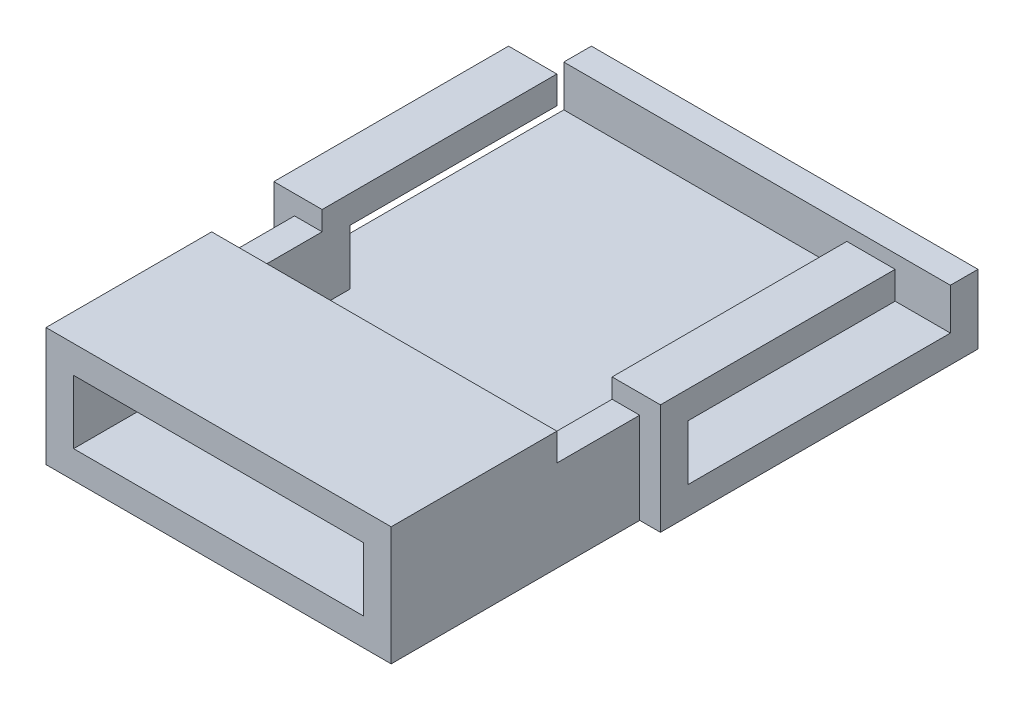
ISO-10303-21;
HEADER;
FILE_DESCRIPTION(('STEP AP214'),'2;1');
FILE_NAME('part.step','',(''),(''),'','','');
FILE_SCHEMA(('AUTOMOTIVE_DESIGN { 1 0 10303 214 1 1 1 1 }'));
ENDSEC;
DATA;
#1=APPLICATION_CONTEXT('core data for automotive mechanical design processes');
#2=APPLICATION_PROTOCOL_DEFINITION('international standard','automotive_design',2000,#1);
#3=PRODUCT_CONTEXT('',#1,'mechanical');
#4=PRODUCT('Part','Part','',(#3));
#5=PRODUCT_RELATED_PRODUCT_CATEGORY('part','',(#4));
#6=PRODUCT_DEFINITION_FORMATION('','',#4);
#7=PRODUCT_DEFINITION_CONTEXT('part definition',#1,'design');
#8=PRODUCT_DEFINITION('design','',#6,#7);
#9=PRODUCT_DEFINITION_SHAPE('','',#8);
#10=(LENGTH_UNIT() NAMED_UNIT(*) SI_UNIT(.MILLI.,.METRE.));
#11=(NAMED_UNIT(*) PLANE_ANGLE_UNIT() SI_UNIT($,.RADIAN.));
#12=(NAMED_UNIT(*) SI_UNIT($,.STERADIAN.) SOLID_ANGLE_UNIT());
#13=UNCERTAINTY_MEASURE_WITH_UNIT(LENGTH_MEASURE(1.E-05),#10,'distance_accuracy_value','');
#14=(GEOMETRIC_REPRESENTATION_CONTEXT(3) GLOBAL_UNCERTAINTY_ASSIGNED_CONTEXT((#13)) GLOBAL_UNIT_ASSIGNED_CONTEXT((#10,
#11,#12)) REPRESENTATION_CONTEXT('',''));
#15=CARTESIAN_POINT('',(0.,0.,0.));
#16=DIRECTION('',(0.,0.,1.));
#17=DIRECTION('',(1.,0.,0.));
#18=AXIS2_PLACEMENT_3D('',#15,#16,#17);
#19=CARTESIAN_POINT('',(-7.,0.,-10.5));
#20=DIRECTION('',(-1.,0.,0.));
#21=DIRECTION('',(0.,0.,1.));
#22=AXIS2_PLACEMENT_3D('',#19,#20,#21);
#23=PLANE('',#22);
#24=DIRECTION('',(0.,1.,0.));
#25=VECTOR('',#24,1.);
#26=CARTESIAN_POINT('',(-7.,1.,-9.5));
#27=LINE('',#26,#25);
#28=CARTESIAN_POINT('',(-7.,1.,-9.5));
#29=VERTEX_POINT('',#28);
#30=CARTESIAN_POINT('',(-7.,2.5,-9.5));
#31=VERTEX_POINT('',#30);
#32=EDGE_CURVE('E318',#29,#31,#27,.T.);
#33=ORIENTED_EDGE('',*,*,#32,.T.);
#34=DIRECTION('',(0.,0.,1.));
#35=VECTOR('',#34,1.);
#36=CARTESIAN_POINT('',(-7.,2.5,-10.5));
#37=LINE('',#36,#35);
#38=CARTESIAN_POINT('',(-7.,2.5,-10.5));
#39=VERTEX_POINT('',#38);
#40=EDGE_CURVE('E54',#39,#31,#37,.T.);
#41=ORIENTED_EDGE('',*,*,#40,.F.);
#42=DIRECTION('',(0.,1.,0.));
#43=VECTOR('',#42,1.);
#44=CARTESIAN_POINT('',(-7.,0.,-10.5));
#45=LINE('',#44,#43);
#46=CARTESIAN_POINT('',(-7.,0.,-10.5));
#47=VERTEX_POINT('',#46);
#48=EDGE_CURVE('E388',#47,#39,#45,.T.);
#49=ORIENTED_EDGE('',*,*,#48,.F.);
#50=DIRECTION('',(0.,0.,1.));
#51=VECTOR('',#50,1.);
#52=CARTESIAN_POINT('',(-7.,0.,-10.5));
#53=LINE('',#52,#51);
#54=CARTESIAN_POINT('',(-7.,0.,1.));
#55=VERTEX_POINT('',#54);
#56=EDGE_CURVE('E363',#47,#55,#53,.T.);
#57=ORIENTED_EDGE('',*,*,#56,.T.);
#58=DIRECTION('',(0.,1.,0.));
#59=VECTOR('',#58,1.);
#60=CARTESIAN_POINT('',(-7.,0.,1.));
#61=LINE('',#60,#59);
#62=CARTESIAN_POINT('',(-7.,4.,1.));
#63=VERTEX_POINT('',#62);
#64=EDGE_CURVE('E232',#55,#63,#61,.T.);
#65=ORIENTED_EDGE('',*,*,#64,.T.);
#66=DIRECTION('',(0.,0.,-1.));
#67=VECTOR('',#66,1.);
#68=CARTESIAN_POINT('',(-7.,4.,0.));
#69=LINE('',#68,#67);
#70=CARTESIAN_POINT('',(-7.,4.,-7.5));
#71=VERTEX_POINT('',#70);
#72=EDGE_CURVE('E224',#63,#71,#69,.T.);
#73=ORIENTED_EDGE('',*,*,#72,.T.);
#74=DIRECTION('',(0.,-1.,0.));
#75=VECTOR('',#74,1.);
#76=CARTESIAN_POINT('',(-7.,4.,-7.5));
#77=LINE('',#76,#75);
#78=CARTESIAN_POINT('',(-7.,3.,-7.5));
#79=VERTEX_POINT('',#78);
#80=EDGE_CURVE('E208',#71,#79,#77,.T.);
#81=ORIENTED_EDGE('',*,*,#80,.T.);
#82=DIRECTION('',(0.,0.,-1.));
#83=VECTOR('',#82,1.);
#84=CARTESIAN_POINT('',(-7.,3.,0.));
#85=LINE('',#84,#83);
#86=CARTESIAN_POINT('',(-7.,3.,0.));
#87=VERTEX_POINT('',#86);
#88=EDGE_CURVE('E241',#87,#79,#85,.T.);
#89=ORIENTED_EDGE('',*,*,#88,.F.);
#90=DIRECTION('',(0.,1.,0.));
#91=VECTOR('',#90,1.);
#92=CARTESIAN_POINT('',(-7.,1.,0.));
#93=LINE('',#92,#91);
#94=CARTESIAN_POINT('',(-7.,1.,0.));
#95=VERTEX_POINT('',#94);
#96=EDGE_CURVE('E320',#95,#87,#93,.T.);
#97=ORIENTED_EDGE('',*,*,#96,.F.);
#98=DIRECTION('',(0.,0.,1.));
#99=VECTOR('',#98,1.);
#100=CARTESIAN_POINT('',(-7.,1.,0.));
#101=LINE('',#100,#99);
#102=EDGE_CURVE('E315',#29,#95,#101,.T.);
#103=ORIENTED_EDGE('',*,*,#102,.F.);
#104=EDGE_LOOP('',(#33,#41,#49,#57,#65,#73,#81,#89,#97,#103));
#105=FACE_BOUND('',#104,.T.);
#106=ADVANCED_FACE('F37',(#105),#23,.T.);
#107=CARTESIAN_POINT('',(7.00000000000001,0.,-10.5));
#108=DIRECTION('',(0.,0.,-1.));
#109=DIRECTION('',(-1.,0.,0.));
#110=AXIS2_PLACEMENT_3D('',#107,#108,#109);
#111=PLANE('',#110);
#112=ORIENTED_EDGE('',*,*,#48,.T.);
#113=DIRECTION('',(-1.,0.,0.));
#114=VECTOR('',#113,1.);
#115=CARTESIAN_POINT('',(7.00000000000001,2.5,-10.5));
#116=LINE('',#115,#114);
#117=CARTESIAN_POINT('',(7.00000000000001,2.5,-10.5));
#118=VERTEX_POINT('',#117);
#119=EDGE_CURVE('E273',#118,#39,#116,.T.);
#120=ORIENTED_EDGE('',*,*,#119,.F.);
#121=DIRECTION('',(0.,1.,0.));
#122=VECTOR('',#121,1.);
#123=CARTESIAN_POINT('',(7.00000000000001,0.,-10.5));
#124=LINE('',#123,#122);
#125=CARTESIAN_POINT('',(7.00000000000001,0.,-10.5));
#126=VERTEX_POINT('',#125);
#127=EDGE_CURVE('E391',#126,#118,#124,.T.);
#128=ORIENTED_EDGE('',*,*,#127,.F.);
#129=DIRECTION('',(-1.,0.,0.));
#130=VECTOR('',#129,1.);
#131=CARTESIAN_POINT('',(7.00000000000001,0.,-10.5));
#132=LINE('',#131,#130);
#133=EDGE_CURVE('E360',#126,#47,#132,.T.);
#134=ORIENTED_EDGE('',*,*,#133,.T.);
#135=EDGE_LOOP('',(#112,#120,#128,#134));
#136=FACE_BOUND('',#135,.T.);
#137=ADVANCED_FACE('F437',(#136),#111,.T.);
#138=CARTESIAN_POINT('',(7.00000000000001,0.,1.));
#139=DIRECTION('',(1.,0.,0.));
#140=DIRECTION('',(0.,0.,-1.));
#141=AXIS2_PLACEMENT_3D('',#138,#139,#140);
#142=PLANE('',#141);
#143=ORIENTED_EDGE('',*,*,#127,.T.);
#144=DIRECTION('',(0.,0.,-1.));
#145=VECTOR('',#144,1.);
#146=CARTESIAN_POINT('',(7.00000000000001,2.5,-9.5));
#147=LINE('',#146,#145);
#148=CARTESIAN_POINT('',(7.00000000000001,2.5,-9.5));
#149=VERTEX_POINT('',#148);
#150=EDGE_CURVE('E278',#149,#118,#147,.T.);
#151=ORIENTED_EDGE('',*,*,#150,.F.);
#152=DIRECTION('',(0.,1.,0.));
#153=VECTOR('',#152,1.);
#154=CARTESIAN_POINT('',(7.00000000000001,1.,-9.5));
#155=LINE('',#154,#153);
#156=CARTESIAN_POINT('',(7.00000000000001,1.,-9.5));
#157=VERTEX_POINT('',#156);
#158=EDGE_CURVE('E319',#157,#149,#155,.T.);
#159=ORIENTED_EDGE('',*,*,#158,.F.);
#160=DIRECTION('',(0.,0.,-1.));
#161=VECTOR('',#160,1.);
#162=CARTESIAN_POINT('',(7.00000000000001,1.,-9.5));
#163=LINE('',#162,#161);
#164=CARTESIAN_POINT('',(7.00000000000001,1.,0.));
#165=VERTEX_POINT('',#164);
#166=EDGE_CURVE('E324',#165,#157,#163,.T.);
#167=ORIENTED_EDGE('',*,*,#166,.F.);
#168=DIRECTION('',(0.,1.,0.));
#169=VECTOR('',#168,1.);
#170=CARTESIAN_POINT('',(7.00000000000001,1.,0.));
#171=LINE('',#170,#169);
#172=CARTESIAN_POINT('',(7.00000000000001,3.,0.));
#173=VERTEX_POINT('',#172);
#174=EDGE_CURVE('E327',#165,#173,#171,.T.);
#175=ORIENTED_EDGE('',*,*,#174,.T.);
#176=DIRECTION('',(0.,0.,-1.));
#177=VECTOR('',#176,1.);
#178=CARTESIAN_POINT('',(7.00000000000001,3.,0.));
#179=LINE('',#178,#177);
#180=CARTESIAN_POINT('',(7.00000000000001,3.,-7.5));
#181=VERTEX_POINT('',#180);
#182=EDGE_CURVE('E251',#173,#181,#179,.T.);
#183=ORIENTED_EDGE('',*,*,#182,.T.);
#184=DIRECTION('',(0.,-1.,0.));
#185=VECTOR('',#184,1.);
#186=CARTESIAN_POINT('',(7.00000000000001,4.,-7.5));
#187=LINE('',#186,#185);
#188=CARTESIAN_POINT('',(7.00000000000001,4.,-7.5));
#189=VERTEX_POINT('',#188);
#190=EDGE_CURVE('E259',#189,#181,#187,.T.);
#191=ORIENTED_EDGE('',*,*,#190,.F.);
#192=DIRECTION('',(0.,0.,-1.));
#193=VECTOR('',#192,1.);
#194=CARTESIAN_POINT('',(7.00000000000001,4.,0.));
#195=LINE('',#194,#193);
#196=CARTESIAN_POINT('',(7.00000000000001,4.,1.));
#197=VERTEX_POINT('',#196);
#198=EDGE_CURVE('E257',#197,#189,#195,.T.);
#199=ORIENTED_EDGE('',*,*,#198,.F.);
#200=DIRECTION('',(0.,1.,0.));
#201=VECTOR('',#200,1.);
#202=CARTESIAN_POINT('',(7.00000000000001,0.,1.));
#203=LINE('',#202,#201);
#204=CARTESIAN_POINT('',(7.00000000000001,0.,1.));
#205=VERTEX_POINT('',#204);
#206=EDGE_CURVE('E377',#205,#197,#203,.T.);
#207=ORIENTED_EDGE('',*,*,#206,.F.);
#208=DIRECTION('',(0.,0.,-1.));
#209=VECTOR('',#208,1.);
#210=CARTESIAN_POINT('',(7.00000000000001,0.,1.));
#211=LINE('',#210,#209);
#212=EDGE_CURVE('E357',#205,#126,#211,.T.);
#213=ORIENTED_EDGE('',*,*,#212,.T.);
#214=EDGE_LOOP('',(#143,#151,#159,#167,#175,#183,#191,#199,#207,#213));
#215=FACE_BOUND('',#214,.T.);
#216=ADVANCED_FACE('F417',(#215),#142,.T.);
#217=CARTESIAN_POINT('',(6.00000000000001,0.,-9.5));
#218=DIRECTION('',(0.,0.,-1.));
#219=DIRECTION('',(-1.,0.,0.));
#220=AXIS2_PLACEMENT_3D('',#217,#218,#219);
#221=PLANE('',#220);
#222=DIRECTION('',(1.,0.,0.));
#223=VECTOR('',#222,1.);
#224=CARTESIAN_POINT('',(-7.,2.5,-9.5));
#225=LINE('',#224,#223);
#226=EDGE_CURVE('E276',#31,#149,#225,.T.);
#227=ORIENTED_EDGE('',*,*,#226,.F.);
#228=ORIENTED_EDGE('',*,*,#32,.F.);
#229=DIRECTION('',(1.,0.,0.));
#230=VECTOR('',#229,1.);
#231=CARTESIAN_POINT('',(0.,1.,-9.5));
#232=LINE('',#231,#230);
#233=EDGE_CURVE('E380',#29,#157,#232,.T.);
#234=ORIENTED_EDGE('',*,*,#233,.T.);
#235=ORIENTED_EDGE('',*,*,#158,.T.);
#236=EDGE_LOOP('',(#227,#228,#234,#235));
#237=FACE_BOUND('',#236,.T.);
#238=ADVANCED_FACE('F442',(#237),#221,.F.);
#239=CARTESIAN_POINT('',(-7.,0.,1.));
#240=DIRECTION('',(0.,0.,1.));
#241=DIRECTION('',(1.,0.,0.));
#242=AXIS2_PLACEMENT_3D('',#239,#240,#241);
#243=PLANE('',#242);
#244=DIRECTION('',(0.,1.,0.));
#245=VECTOR('',#244,1.);
#246=CARTESIAN_POINT('',(-6.25,0.,1.));
#247=LINE('',#246,#245);
#248=CARTESIAN_POINT('',(-6.25,0.,1.));
#249=VERTEX_POINT('',#248);
#250=CARTESIAN_POINT('',(-6.25,3.3,1.));
#251=VERTEX_POINT('',#250);
#252=EDGE_CURVE('E385',#249,#251,#247,.T.);
#253=ORIENTED_EDGE('',*,*,#252,.T.);
#254=DIRECTION('',(1.,0.,0.));
#255=VECTOR('',#254,1.);
#256=CARTESIAN_POINT('',(-7.,3.3,1.));
#257=LINE('',#256,#255);
#258=CARTESIAN_POINT('',(-5.25,3.3,1.));
#259=VERTEX_POINT('',#258);
#260=EDGE_CURVE('E285',#251,#259,#257,.T.);
#261=ORIENTED_EDGE('',*,*,#260,.T.);
#262=DIRECTION('',(0.,-1.,0.));
#263=VECTOR('',#262,1.);
#264=CARTESIAN_POINT('',(-5.25,4.,1.));
#265=LINE('',#264,#263);
#266=CARTESIAN_POINT('',(-5.25,4.,1.));
#267=VERTEX_POINT('',#266);
#268=EDGE_CURVE('E219',#267,#259,#265,.T.);
#269=ORIENTED_EDGE('',*,*,#268,.F.);
#270=DIRECTION('',(1.,0.,0.));
#271=VECTOR('',#270,1.);
#272=CARTESIAN_POINT('',(0.,4.,1.));
#273=LINE('',#272,#271);
#274=EDGE_CURVE('E234',#63,#267,#273,.T.);
#275=ORIENTED_EDGE('',*,*,#274,.F.);
#276=ORIENTED_EDGE('',*,*,#64,.F.);
#277=DIRECTION('',(1.,0.,0.));
#278=VECTOR('',#277,1.);
#279=CARTESIAN_POINT('',(-7.,0.,1.));
#280=LINE('',#279,#278);
#281=EDGE_CURVE('E365',#55,#249,#280,.T.);
#282=ORIENTED_EDGE('',*,*,#281,.T.);
#283=EDGE_LOOP('',(#253,#261,#269,#275,#276,#282));
#284=FACE_BOUND('',#283,.T.);
#285=ADVANCED_FACE('F457',(#284),#243,.T.);
#286=CARTESIAN_POINT('',(-6.,0.,0.));
#287=DIRECTION('',(0.,0.,1.));
#288=DIRECTION('',(1.,0.,0.));
#289=AXIS2_PLACEMENT_3D('',#286,#287,#288);
#290=PLANE('',#289);
#291=DIRECTION('',(-1.,0.,0.));
#292=VECTOR('',#291,1.);
#293=CARTESIAN_POINT('',(-7.,3.,0.));
#294=LINE('',#293,#292);
#295=CARTESIAN_POINT('',(-5.25,3.,0.));
#296=VERTEX_POINT('',#295);
#297=EDGE_CURVE('E281',#296,#87,#294,.T.);
#298=ORIENTED_EDGE('',*,*,#297,.F.);
#299=DIRECTION('',(0.,1.,0.));
#300=VECTOR('',#299,1.);
#301=CARTESIAN_POINT('',(-5.25,0.,0.));
#302=LINE('',#301,#300);
#303=CARTESIAN_POINT('',(-5.25,1.,0.));
#304=VERTEX_POINT('',#303);
#305=EDGE_CURVE('E351',#304,#296,#302,.T.);
#306=ORIENTED_EDGE('',*,*,#305,.F.);
#307=DIRECTION('',(1.,0.,0.));
#308=VECTOR('',#307,1.);
#309=CARTESIAN_POINT('',(0.,1.,0.));
#310=LINE('',#309,#308);
#311=EDGE_CURVE('E47',#95,#304,#310,.T.);
#312=ORIENTED_EDGE('',*,*,#311,.F.);
#313=ORIENTED_EDGE('',*,*,#96,.T.);
#314=EDGE_LOOP('',(#298,#306,#312,#313));
#315=FACE_BOUND('',#314,.T.);
#316=ADVANCED_FACE('F448',(#315),#290,.F.);
#317=CARTESIAN_POINT('',(0.,3.3,0.));
#318=DIRECTION('',(0.,1.,0.));
#319=DIRECTION('',(0.,0.,1.));
#320=AXIS2_PLACEMENT_3D('',#317,#318,#319);
#321=PLANE('',#320);
#322=ORIENTED_EDGE('',*,*,#260,.F.);
#323=DIRECTION('',(0.,0.,1.));
#324=VECTOR('',#323,1.);
#325=CARTESIAN_POINT('',(-6.25,3.3,1.));
#326=LINE('',#325,#324);
#327=CARTESIAN_POINT('',(-6.25,3.3,4.));
#328=VERTEX_POINT('',#327);
#329=EDGE_CURVE('E345',#251,#328,#326,.T.);
#330=ORIENTED_EDGE('',*,*,#329,.T.);
#331=DIRECTION('',(-1.,0.,0.));
#332=VECTOR('',#331,1.);
#333=CARTESIAN_POINT('',(-6.25,3.3,4.));
#334=LINE('',#333,#332);
#335=CARTESIAN_POINT('',(-5.25,3.3,4.));
#336=VERTEX_POINT('',#335);
#337=EDGE_CURVE('E306',#336,#328,#334,.T.);
#338=ORIENTED_EDGE('',*,*,#337,.F.);
#339=DIRECTION('',(0.,0.,1.));
#340=VECTOR('',#339,1.);
#341=CARTESIAN_POINT('',(-5.25,3.3,0.));
#342=LINE('',#341,#340);
#343=EDGE_CURVE('E339',#259,#336,#342,.T.);
#344=ORIENTED_EDGE('',*,*,#343,.F.);
#345=EDGE_LOOP('',(#322,#330,#338,#344));
#346=FACE_BOUND('',#345,.T.);
#347=ADVANCED_FACE('F461',(#346),#321,.T.);
#348=DIRECTION('',(1.,0.,0.));
#349=VECTOR('',#348,1.);
#350=CARTESIAN_POINT('',(7.00000000000001,3.3,1.));
#351=LINE('',#350,#349);
#352=CARTESIAN_POINT('',(5.25,3.3,1.));
#353=VERTEX_POINT('',#352);
#354=CARTESIAN_POINT('',(6.25,3.3,1.));
#355=VERTEX_POINT('',#354);
#356=EDGE_CURVE('E280',#353,#355,#351,.T.);
#357=ORIENTED_EDGE('',*,*,#356,.F.);
#358=DIRECTION('',(0.,0.,-1.));
#359=VECTOR('',#358,1.);
#360=CARTESIAN_POINT('',(5.25,3.3,9.));
#361=LINE('',#360,#359);
#362=CARTESIAN_POINT('',(5.25,3.3,4.));
#363=VERTEX_POINT('',#362);
#364=EDGE_CURVE('E341',#363,#353,#361,.T.);
#365=ORIENTED_EDGE('',*,*,#364,.F.);
#366=CARTESIAN_POINT('',(6.25,3.3,4.));
#367=VERTEX_POINT('',#366);
#368=EDGE_CURVE('E296',#367,#363,#334,.T.);
#369=ORIENTED_EDGE('',*,*,#368,.F.);
#370=DIRECTION('',(0.,0.,-1.));
#371=VECTOR('',#370,1.);
#372=CARTESIAN_POINT('',(6.25,3.3,10.));
#373=LINE('',#372,#371);
#374=EDGE_CURVE('E348',#367,#355,#373,.T.);
#375=ORIENTED_EDGE('',*,*,#374,.T.);
#376=EDGE_LOOP('',(#357,#365,#369,#375));
#377=FACE_BOUND('',#376,.T.);
#378=ADVANCED_FACE('F490',(#377),#321,.T.);
#379=CARTESIAN_POINT('',(0.,1.,0.));
#380=DIRECTION('',(0.,1.,0.));
#381=DIRECTION('',(0.,0.,1.));
#382=AXIS2_PLACEMENT_3D('',#379,#380,#381);
#383=PLANE('',#382);
#384=CARTESIAN_POINT('',(5.25,1.,0.));
#385=VERTEX_POINT('',#384);
#386=EDGE_CURVE('E11',#385,#165,#310,.T.);
#387=ORIENTED_EDGE('',*,*,#386,.T.);
#388=ORIENTED_EDGE('',*,*,#166,.T.);
#389=ORIENTED_EDGE('',*,*,#233,.F.);
#390=ORIENTED_EDGE('',*,*,#102,.T.);
#391=ORIENTED_EDGE('',*,*,#311,.T.);
#392=DIRECTION('',(0.,0.,-1.));
#393=VECTOR('',#392,1.);
#394=CARTESIAN_POINT('',(-5.25,1.,0.));
#395=LINE('',#394,#393);
#396=CARTESIAN_POINT('',(-5.25,1.,10.));
#397=VERTEX_POINT('',#396);
#398=EDGE_CURVE('E395',#397,#304,#395,.T.);
#399=ORIENTED_EDGE('',*,*,#398,.F.);
#400=DIRECTION('',(1.,0.,0.));
#401=VECTOR('',#400,1.);
#402=CARTESIAN_POINT('',(-5.25,1.,10.));
#403=LINE('',#402,#401);
#404=CARTESIAN_POINT('',(5.25,1.,10.));
#405=VERTEX_POINT('',#404);
#406=EDGE_CURVE('E314',#397,#405,#403,.T.);
#407=ORIENTED_EDGE('',*,*,#406,.T.);
#408=DIRECTION('',(0.,0.,-1.));
#409=VECTOR('',#408,1.);
#410=CARTESIAN_POINT('',(5.25,1.,0.));
#411=LINE('',#410,#409);
#412=EDGE_CURVE('E41',#405,#385,#411,.T.);
#413=ORIENTED_EDGE('',*,*,#412,.T.);
#414=EDGE_LOOP('',(#387,#388,#389,#390,#391,#399,#407,#413));
#415=FACE_BOUND('',#414,.T.);
#416=ADVANCED_FACE('F401',(#415),#383,.T.);
#417=CARTESIAN_POINT('',(6.25,0.,1.));
#418=DIRECTION('',(0.,0.,1.));
#419=DIRECTION('',(1.,0.,0.));
#420=AXIS2_PLACEMENT_3D('',#417,#418,#419);
#421=PLANE('',#420);
#422=ORIENTED_EDGE('',*,*,#206,.T.);
#423=DIRECTION('',(-1.,0.,0.));
#424=VECTOR('',#423,1.);
#425=CARTESIAN_POINT('',(0.,4.,1.));
#426=LINE('',#425,#424);
#427=CARTESIAN_POINT('',(5.25,4.,1.));
#428=VERTEX_POINT('',#427);
#429=EDGE_CURVE('E254',#197,#428,#426,.T.);
#430=ORIENTED_EDGE('',*,*,#429,.T.);
#431=DIRECTION('',(0.,-1.,0.));
#432=VECTOR('',#431,1.);
#433=CARTESIAN_POINT('',(5.25,4.,1.));
#434=LINE('',#433,#432);
#435=EDGE_CURVE('E267',#428,#353,#434,.T.);
#436=ORIENTED_EDGE('',*,*,#435,.T.);
#437=ORIENTED_EDGE('',*,*,#356,.T.);
#438=DIRECTION('',(0.,1.,0.));
#439=VECTOR('',#438,1.);
#440=CARTESIAN_POINT('',(6.25,0.,1.));
#441=LINE('',#440,#439);
#442=CARTESIAN_POINT('',(6.25,0.,1.));
#443=VERTEX_POINT('',#442);
#444=EDGE_CURVE('E378',#443,#355,#441,.T.);
#445=ORIENTED_EDGE('',*,*,#444,.F.);
#446=DIRECTION('',(1.,0.,0.));
#447=VECTOR('',#446,1.);
#448=CARTESIAN_POINT('',(6.25,0.,1.));
#449=LINE('',#448,#447);
#450=EDGE_CURVE('E353',#443,#205,#449,.T.);
#451=ORIENTED_EDGE('',*,*,#450,.T.);
#452=EDGE_LOOP('',(#422,#430,#436,#437,#445,#451));
#453=FACE_BOUND('',#452,.T.);
#454=ADVANCED_FACE('F428',(#453),#421,.T.);
#455=CARTESIAN_POINT('',(6.25,0.,10.));
#456=DIRECTION('',(1.,0.,0.));
#457=DIRECTION('',(0.,0.,-1.));
#458=AXIS2_PLACEMENT_3D('',#455,#456,#457);
#459=PLANE('',#458);
#460=ORIENTED_EDGE('',*,*,#444,.T.);
#461=ORIENTED_EDGE('',*,*,#374,.F.);
#462=DIRECTION('',(0.,-1.,0.));
#463=VECTOR('',#462,1.);
#464=CARTESIAN_POINT('',(6.25,4.3,4.));
#465=LINE('',#464,#463);
#466=CARTESIAN_POINT('',(6.25,4.3,4.));
#467=VERTEX_POINT('',#466);
#468=EDGE_CURVE('E312',#467,#367,#465,.T.);
#469=ORIENTED_EDGE('',*,*,#468,.F.);
#470=DIRECTION('',(0.,0.,-1.));
#471=VECTOR('',#470,1.);
#472=CARTESIAN_POINT('',(6.25,4.3,10.));
#473=LINE('',#472,#471);
#474=CARTESIAN_POINT('',(6.25,4.3,10.));
#475=VERTEX_POINT('',#474);
#476=EDGE_CURVE('E299',#475,#467,#473,.T.);
#477=ORIENTED_EDGE('',*,*,#476,.F.);
#478=DIRECTION('',(0.,1.,0.));
#479=VECTOR('',#478,1.);
#480=CARTESIAN_POINT('',(6.25,0.,10.));
#481=LINE('',#480,#479);
#482=CARTESIAN_POINT('',(6.25,0.,10.));
#483=VERTEX_POINT('',#482);
#484=EDGE_CURVE('E381',#483,#475,#481,.T.);
#485=ORIENTED_EDGE('',*,*,#484,.F.);
#486=DIRECTION('',(0.,0.,-1.));
#487=VECTOR('',#486,1.);
#488=CARTESIAN_POINT('',(6.25,0.,10.));
#489=LINE('',#488,#487);
#490=EDGE_CURVE('E374',#483,#443,#489,.T.);
#491=ORIENTED_EDGE('',*,*,#490,.T.);
#492=EDGE_LOOP('',(#460,#461,#469,#477,#485,#491));
#493=FACE_BOUND('',#492,.T.);
#494=ADVANCED_FACE('F479',(#493),#459,.T.);
#495=CARTESIAN_POINT('',(-6.25,0.,10.));
#496=DIRECTION('',(0.,0.,1.));
#497=DIRECTION('',(1.,0.,0.));
#498=AXIS2_PLACEMENT_3D('',#495,#496,#497);
#499=PLANE('',#498);
#500=DIRECTION('',(0.,1.,0.));
#501=VECTOR('',#500,1.);
#502=CARTESIAN_POINT('',(-5.25,1.,10.));
#503=LINE('',#502,#501);
#504=CARTESIAN_POINT('',(-5.25,3.3,10.));
#505=VERTEX_POINT('',#504);
#506=EDGE_CURVE('E334',#397,#505,#503,.T.);
#507=ORIENTED_EDGE('',*,*,#506,.T.);
#508=DIRECTION('',(1.,0.,0.));
#509=VECTOR('',#508,1.);
#510=CARTESIAN_POINT('',(-6.25,3.3,10.));
#511=LINE('',#510,#509);
#512=CARTESIAN_POINT('',(5.25,3.3,10.));
#513=VERTEX_POINT('',#512);
#514=EDGE_CURVE('E284',#505,#513,#511,.T.);
#515=ORIENTED_EDGE('',*,*,#514,.T.);
#516=DIRECTION('',(0.,1.,0.));
#517=VECTOR('',#516,1.);
#518=CARTESIAN_POINT('',(5.25,1.,10.));
#519=LINE('',#518,#517);
#520=EDGE_CURVE('E328',#405,#513,#519,.T.);
#521=ORIENTED_EDGE('',*,*,#520,.F.);
#522=ORIENTED_EDGE('',*,*,#406,.F.);
#523=EDGE_LOOP('',(#507,#515,#521,#522));
#524=FACE_BOUND('',#523,.T.);
#525=DIRECTION('',(1.,0.,0.));
#526=VECTOR('',#525,1.);
#527=CARTESIAN_POINT('',(-6.25,4.3,10.));
#528=LINE('',#527,#526);
#529=CARTESIAN_POINT('',(-6.25,4.3,10.));
#530=VERTEX_POINT('',#529);
#531=EDGE_CURVE('E295',#530,#475,#528,.T.);
#532=ORIENTED_EDGE('',*,*,#531,.F.);
#533=DIRECTION('',(0.,1.,0.));
#534=VECTOR('',#533,1.);
#535=CARTESIAN_POINT('',(-6.25,0.,10.));
#536=LINE('',#535,#534);
#537=CARTESIAN_POINT('',(-6.25,0.,10.));
#538=VERTEX_POINT('',#537);
#539=EDGE_CURVE('E383',#538,#530,#536,.T.);
#540=ORIENTED_EDGE('',*,*,#539,.F.);
#541=DIRECTION('',(1.,0.,0.));
#542=VECTOR('',#541,1.);
#543=CARTESIAN_POINT('',(-6.25,0.,10.));
#544=LINE('',#543,#542);
#545=EDGE_CURVE('E371',#538,#483,#544,.T.);
#546=ORIENTED_EDGE('',*,*,#545,.T.);
#547=ORIENTED_EDGE('',*,*,#484,.T.);
#548=EDGE_LOOP('',(#532,#540,#546,#547));
#549=FACE_BOUND('',#548,.T.);
#550=ADVANCED_FACE('F476',(#524,#549),#499,.T.);
#551=CARTESIAN_POINT('',(-6.25,0.,1.));
#552=DIRECTION('',(-1.,0.,0.));
#553=DIRECTION('',(0.,0.,1.));
#554=AXIS2_PLACEMENT_3D('',#551,#552,#553);
#555=PLANE('',#554);
#556=ORIENTED_EDGE('',*,*,#539,.T.);
#557=DIRECTION('',(0.,0.,1.));
#558=VECTOR('',#557,1.);
#559=CARTESIAN_POINT('',(-6.25,4.3,10.));
#560=LINE('',#559,#558);
#561=CARTESIAN_POINT('',(-6.25,4.3,4.));
#562=VERTEX_POINT('',#561);
#563=EDGE_CURVE('E292',#562,#530,#560,.T.);
#564=ORIENTED_EDGE('',*,*,#563,.F.);
#565=DIRECTION('',(0.,-1.,0.));
#566=VECTOR('',#565,1.);
#567=CARTESIAN_POINT('',(-6.25,4.3,4.));
#568=LINE('',#567,#566);
#569=EDGE_CURVE('E303',#562,#328,#568,.T.);
#570=ORIENTED_EDGE('',*,*,#569,.T.);
#571=ORIENTED_EDGE('',*,*,#329,.F.);
#572=ORIENTED_EDGE('',*,*,#252,.F.);
#573=DIRECTION('',(0.,0.,1.));
#574=VECTOR('',#573,1.);
#575=CARTESIAN_POINT('',(-6.25,0.,1.));
#576=LINE('',#575,#574);
#577=EDGE_CURVE('E368',#249,#538,#576,.T.);
#578=ORIENTED_EDGE('',*,*,#577,.T.);
#579=EDGE_LOOP('',(#556,#564,#570,#571,#572,#578));
#580=FACE_BOUND('',#579,.T.);
#581=ADVANCED_FACE('F464',(#580),#555,.T.);
#582=CARTESIAN_POINT('',(5.25,0.,0.));
#583=DIRECTION('',(0.,0.,1.));
#584=DIRECTION('',(1.,0.,0.));
#585=AXIS2_PLACEMENT_3D('',#582,#583,#584);
#586=PLANE('',#585);
#587=DIRECTION('',(0.,1.,0.));
#588=VECTOR('',#587,1.);
#589=CARTESIAN_POINT('',(5.25,0.,0.));
#590=LINE('',#589,#588);
#591=CARTESIAN_POINT('',(5.25,3.,0.));
#592=VERTEX_POINT('',#591);
#593=EDGE_CURVE('E62',#385,#592,#590,.T.);
#594=ORIENTED_EDGE('',*,*,#593,.T.);
#595=DIRECTION('',(-1.,0.,0.));
#596=VECTOR('',#595,1.);
#597=CARTESIAN_POINT('',(7.00000000000001,3.,0.));
#598=LINE('',#597,#596);
#599=EDGE_CURVE('E288',#173,#592,#598,.T.);
#600=ORIENTED_EDGE('',*,*,#599,.F.);
#601=ORIENTED_EDGE('',*,*,#174,.F.);
#602=ORIENTED_EDGE('',*,*,#386,.F.);
#603=EDGE_LOOP('',(#594,#600,#601,#602));
#604=FACE_BOUND('',#603,.T.);
#605=ADVANCED_FACE('F406',(#604),#586,.F.);
#606=CARTESIAN_POINT('',(5.25,0.,9.));
#607=DIRECTION('',(1.,0.,0.));
#608=DIRECTION('',(0.,0.,-1.));
#609=AXIS2_PLACEMENT_3D('',#606,#607,#608);
#610=PLANE('',#609);
#611=ORIENTED_EDGE('',*,*,#364,.T.);
#612=ORIENTED_EDGE('',*,*,#435,.F.);
#613=DIRECTION('',(0.,0.,-1.));
#614=VECTOR('',#613,1.);
#615=CARTESIAN_POINT('',(5.25,4.,0.));
#616=LINE('',#615,#614);
#617=CARTESIAN_POINT('',(5.25,4.,-7.5));
#618=VERTEX_POINT('',#617);
#619=EDGE_CURVE('E250',#428,#618,#616,.T.);
#620=ORIENTED_EDGE('',*,*,#619,.T.);
#621=DIRECTION('',(0.,-1.,0.));
#622=VECTOR('',#621,1.);
#623=CARTESIAN_POINT('',(5.25,4.,-7.5));
#624=LINE('',#623,#622);
#625=CARTESIAN_POINT('',(5.25,3.,-7.5));
#626=VERTEX_POINT('',#625);
#627=EDGE_CURVE('E270',#618,#626,#624,.T.);
#628=ORIENTED_EDGE('',*,*,#627,.T.);
#629=DIRECTION('',(0.,0.,-1.));
#630=VECTOR('',#629,1.);
#631=CARTESIAN_POINT('',(5.25,3.,0.));
#632=LINE('',#631,#630);
#633=EDGE_CURVE('E262',#592,#626,#632,.T.);
#634=ORIENTED_EDGE('',*,*,#633,.F.);
#635=ORIENTED_EDGE('',*,*,#593,.F.);
#636=ORIENTED_EDGE('',*,*,#412,.F.);
#637=ORIENTED_EDGE('',*,*,#520,.T.);
#638=EDGE_CURVE('E342',#513,#363,#361,.T.);
#639=ORIENTED_EDGE('',*,*,#638,.T.);
#640=EDGE_LOOP('',(#611,#612,#620,#628,#634,#635,#636,#637,#639));
#641=FACE_BOUND('',#640,.T.);
#642=ADVANCED_FACE('F410',(#641),#610,.F.);
#643=CARTESIAN_POINT('',(-5.25,0.,0.));
#644=DIRECTION('',(-1.,0.,0.));
#645=DIRECTION('',(0.,0.,1.));
#646=AXIS2_PLACEMENT_3D('',#643,#644,#645);
#647=PLANE('',#646);
#648=ORIENTED_EDGE('',*,*,#268,.T.);
#649=ORIENTED_EDGE('',*,*,#343,.T.);
#650=EDGE_CURVE('E322',#336,#505,#342,.T.);
#651=ORIENTED_EDGE('',*,*,#650,.T.);
#652=ORIENTED_EDGE('',*,*,#506,.F.);
#653=ORIENTED_EDGE('',*,*,#398,.T.);
#654=ORIENTED_EDGE('',*,*,#305,.T.);
#655=DIRECTION('',(0.,0.,-1.));
#656=VECTOR('',#655,1.);
#657=CARTESIAN_POINT('',(-5.25,3.,0.));
#658=LINE('',#657,#656);
#659=CARTESIAN_POINT('',(-5.25,3.,-7.5));
#660=VERTEX_POINT('',#659);
#661=EDGE_CURVE('E228',#296,#660,#658,.T.);
#662=ORIENTED_EDGE('',*,*,#661,.T.);
#663=DIRECTION('',(0.,-1.,0.));
#664=VECTOR('',#663,1.);
#665=CARTESIAN_POINT('',(-5.25,4.,-7.5));
#666=LINE('',#665,#664);
#667=CARTESIAN_POINT('',(-5.25,4.,-7.5));
#668=VERTEX_POINT('',#667);
#669=EDGE_CURVE('E239',#668,#660,#666,.T.);
#670=ORIENTED_EDGE('',*,*,#669,.F.);
#671=DIRECTION('',(0.,0.,-1.));
#672=VECTOR('',#671,1.);
#673=CARTESIAN_POINT('',(-5.25,4.,0.));
#674=LINE('',#673,#672);
#675=EDGE_CURVE('E226',#267,#668,#674,.T.);
#676=ORIENTED_EDGE('',*,*,#675,.F.);
#677=EDGE_LOOP('',(#648,#649,#651,#652,#653,#654,#662,#670,#676));
#678=FACE_BOUND('',#677,.T.);
#679=ADVANCED_FACE('F452',(#678),#647,.F.);
#680=CARTESIAN_POINT('',(0.,0.,0.));
#681=DIRECTION('',(0.,1.,0.));
#682=DIRECTION('',(0.,0.,1.));
#683=AXIS2_PLACEMENT_3D('',#680,#681,#682);
#684=PLANE('',#683);
#685=ORIENTED_EDGE('',*,*,#450,.F.);
#686=ORIENTED_EDGE('',*,*,#490,.F.);
#687=ORIENTED_EDGE('',*,*,#545,.F.);
#688=ORIENTED_EDGE('',*,*,#577,.F.);
#689=ORIENTED_EDGE('',*,*,#281,.F.);
#690=ORIENTED_EDGE('',*,*,#56,.F.);
#691=ORIENTED_EDGE('',*,*,#133,.F.);
#692=ORIENTED_EDGE('',*,*,#212,.F.);
#693=EDGE_LOOP('',(#685,#686,#687,#688,#689,#690,#691,#692));
#694=FACE_BOUND('',#693,.T.);
#695=ADVANCED_FACE('F39',(#694),#684,.F.);
#696=CARTESIAN_POINT('',(0.,3.3,0.));
#697=DIRECTION('',(0.,-1.,0.));
#698=DIRECTION('',(0.,0.,-1.));
#699=AXIS2_PLACEMENT_3D('',#696,#697,#698);
#700=PLANE('',#699);
#701=ORIENTED_EDGE('',*,*,#638,.F.);
#702=ORIENTED_EDGE('',*,*,#514,.F.);
#703=ORIENTED_EDGE('',*,*,#650,.F.);
#704=EDGE_CURVE('E309',#363,#336,#334,.T.);
#705=ORIENTED_EDGE('',*,*,#704,.F.);
#706=EDGE_LOOP('',(#701,#702,#703,#705));
#707=FACE_BOUND('',#706,.T.);
#708=ADVANCED_FACE('F474',(#707),#700,.T.);
#709=CARTESIAN_POINT('',(-6.25,4.3,4.));
#710=DIRECTION('',(0.,0.,1.));
#711=DIRECTION('',(1.,0.,0.));
#712=AXIS2_PLACEMENT_3D('',#709,#710,#711);
#713=PLANE('',#712);
#714=ORIENTED_EDGE('',*,*,#368,.T.);
#715=ORIENTED_EDGE('',*,*,#704,.T.);
#716=ORIENTED_EDGE('',*,*,#337,.T.);
#717=ORIENTED_EDGE('',*,*,#569,.F.);
#718=DIRECTION('',(-1.,0.,0.));
#719=VECTOR('',#718,1.);
#720=CARTESIAN_POINT('',(-6.25,4.3,4.));
#721=LINE('',#720,#719);
#722=EDGE_CURVE('E301',#467,#562,#721,.T.);
#723=ORIENTED_EDGE('',*,*,#722,.F.);
#724=ORIENTED_EDGE('',*,*,#468,.T.);
#725=EDGE_LOOP('',(#714,#715,#716,#717,#723,#724));
#726=FACE_BOUND('',#725,.T.);
#727=ADVANCED_FACE('F470',(#726),#713,.F.);
#728=CARTESIAN_POINT('',(0.,4.3,0.));
#729=DIRECTION('',(0.,-1.,0.));
#730=DIRECTION('',(0.,0.,-1.));
#731=AXIS2_PLACEMENT_3D('',#728,#729,#730);
#732=PLANE('',#731);
#733=ORIENTED_EDGE('',*,*,#563,.T.);
#734=ORIENTED_EDGE('',*,*,#531,.T.);
#735=ORIENTED_EDGE('',*,*,#476,.T.);
#736=ORIENTED_EDGE('',*,*,#722,.T.);
#737=EDGE_LOOP('',(#733,#734,#735,#736));
#738=FACE_BOUND('',#737,.T.);
#739=ADVANCED_FACE('F485',(#738),#732,.F.);
#740=CARTESIAN_POINT('',(0.,2.5,0.));
#741=DIRECTION('',(0.,1.,0.));
#742=DIRECTION('',(0.,0.,1.));
#743=AXIS2_PLACEMENT_3D('',#740,#741,#742);
#744=PLANE('',#743);
#745=ORIENTED_EDGE('',*,*,#119,.T.);
#746=ORIENTED_EDGE('',*,*,#40,.T.);
#747=ORIENTED_EDGE('',*,*,#226,.T.);
#748=ORIENTED_EDGE('',*,*,#150,.T.);
#749=EDGE_LOOP('',(#745,#746,#747,#748));
#750=FACE_BOUND('',#749,.T.);
#751=ADVANCED_FACE('F597',(#750),#744,.T.);
#752=CARTESIAN_POINT('',(0.,3.,0.));
#753=DIRECTION('',(0.,1.,0.));
#754=DIRECTION('',(0.,0.,1.));
#755=AXIS2_PLACEMENT_3D('',#752,#753,#754);
#756=PLANE('',#755);
#757=ORIENTED_EDGE('',*,*,#182,.F.);
#758=ORIENTED_EDGE('',*,*,#599,.T.);
#759=ORIENTED_EDGE('',*,*,#633,.T.);
#760=DIRECTION('',(1.,0.,0.));
#761=VECTOR('',#760,1.);
#762=CARTESIAN_POINT('',(0.,3.,-7.5));
#763=LINE('',#762,#761);
#764=EDGE_CURVE('E218',#626,#181,#763,.T.);
#765=ORIENTED_EDGE('',*,*,#764,.T.);
#766=EDGE_LOOP('',(#757,#758,#759,#765));
#767=FACE_BOUND('',#766,.T.);
#768=ADVANCED_FACE('F414',(#767),#756,.F.);
#769=CARTESIAN_POINT('',(0.,4.,-7.5));
#770=DIRECTION('',(0.,0.,-1.));
#771=DIRECTION('',(-1.,0.,0.));
#772=AXIS2_PLACEMENT_3D('',#769,#770,#771);
#773=PLANE('',#772);
#774=ORIENTED_EDGE('',*,*,#764,.F.);
#775=ORIENTED_EDGE('',*,*,#627,.F.);
#776=DIRECTION('',(1.,0.,0.));
#777=VECTOR('',#776,1.);
#778=CARTESIAN_POINT('',(0.,4.,-7.5));
#779=LINE('',#778,#777);
#780=EDGE_CURVE('E247',#618,#189,#779,.T.);
#781=ORIENTED_EDGE('',*,*,#780,.T.);
#782=ORIENTED_EDGE('',*,*,#190,.T.);
#783=EDGE_LOOP('',(#774,#775,#781,#782));
#784=FACE_BOUND('',#783,.T.);
#785=ADVANCED_FACE('F420',(#784),#773,.T.);
#786=CARTESIAN_POINT('',(0.,4.,0.));
#787=DIRECTION('',(0.,1.,0.));
#788=DIRECTION('',(0.,0.,1.));
#789=AXIS2_PLACEMENT_3D('',#786,#787,#788);
#790=PLANE('',#789);
#791=ORIENTED_EDGE('',*,*,#780,.F.);
#792=ORIENTED_EDGE('',*,*,#619,.F.);
#793=ORIENTED_EDGE('',*,*,#429,.F.);
#794=ORIENTED_EDGE('',*,*,#198,.T.);
#795=EDGE_LOOP('',(#791,#792,#793,#794));
#796=FACE_BOUND('',#795,.T.);
#797=ADVANCED_FACE('F424',(#796),#790,.T.);
#798=CARTESIAN_POINT('',(0.,3.,0.));
#799=DIRECTION('',(0.,1.,0.));
#800=DIRECTION('',(0.,0.,1.));
#801=AXIS2_PLACEMENT_3D('',#798,#799,#800);
#802=PLANE('',#801);
#803=ORIENTED_EDGE('',*,*,#661,.F.);
#804=ORIENTED_EDGE('',*,*,#297,.T.);
#805=ORIENTED_EDGE('',*,*,#88,.T.);
#806=DIRECTION('',(1.,0.,0.));
#807=VECTOR('',#806,1.);
#808=CARTESIAN_POINT('',(0.,3.,-7.5));
#809=LINE('',#808,#807);
#810=EDGE_CURVE('E214',#79,#660,#809,.T.);
#811=ORIENTED_EDGE('',*,*,#810,.T.);
#812=EDGE_LOOP('',(#803,#804,#805,#811));
#813=FACE_BOUND('',#812,.T.);
#814=ADVANCED_FACE('F451',(#813),#802,.F.);
#815=CARTESIAN_POINT('',(0.,4.,-7.5));
#816=DIRECTION('',(0.,0.,-1.));
#817=DIRECTION('',(-1.,0.,0.));
#818=AXIS2_PLACEMENT_3D('',#815,#816,#817);
#819=PLANE('',#818);
#820=ORIENTED_EDGE('',*,*,#810,.F.);
#821=ORIENTED_EDGE('',*,*,#80,.F.);
#822=DIRECTION('',(1.,0.,0.));
#823=VECTOR('',#822,1.);
#824=CARTESIAN_POINT('',(0.,4.,-7.5));
#825=LINE('',#824,#823);
#826=EDGE_CURVE('E212',#71,#668,#825,.T.);
#827=ORIENTED_EDGE('',*,*,#826,.T.);
#828=ORIENTED_EDGE('',*,*,#669,.T.);
#829=EDGE_LOOP('',(#820,#821,#827,#828));
#830=FACE_BOUND('',#829,.T.);
#831=ADVANCED_FACE('F210',(#830),#819,.T.);
#832=CARTESIAN_POINT('',(0.,4.,0.));
#833=DIRECTION('',(0.,1.,0.));
#834=DIRECTION('',(0.,0.,1.));
#835=AXIS2_PLACEMENT_3D('',#832,#833,#834);
#836=PLANE('',#835);
#837=ORIENTED_EDGE('',*,*,#826,.F.);
#838=ORIENTED_EDGE('',*,*,#72,.F.);
#839=ORIENTED_EDGE('',*,*,#274,.T.);
#840=ORIENTED_EDGE('',*,*,#675,.T.);
#841=EDGE_LOOP('',(#837,#838,#839,#840));
#842=FACE_BOUND('',#841,.T.);
#843=ADVANCED_FACE('F223',(#842),#836,.T.);
#844=CLOSED_SHELL('',(#106,#137,#216,#238,#285,#316,#347,#378,#416,#454,#494,#550,#581,#605,
#642,#679,#695,#708,#727,#739,#751,#768,#785,#797,#814,#831,#843));
#845=MANIFOLD_SOLID_BREP('B2',#844);
#846=ADVANCED_BREP_SHAPE_REPRESENTATION('',(#18,#845),#14);
#847=SHAPE_DEFINITION_REPRESENTATION(#9,#846);
ENDSEC;
END-ISO-10303-21;
